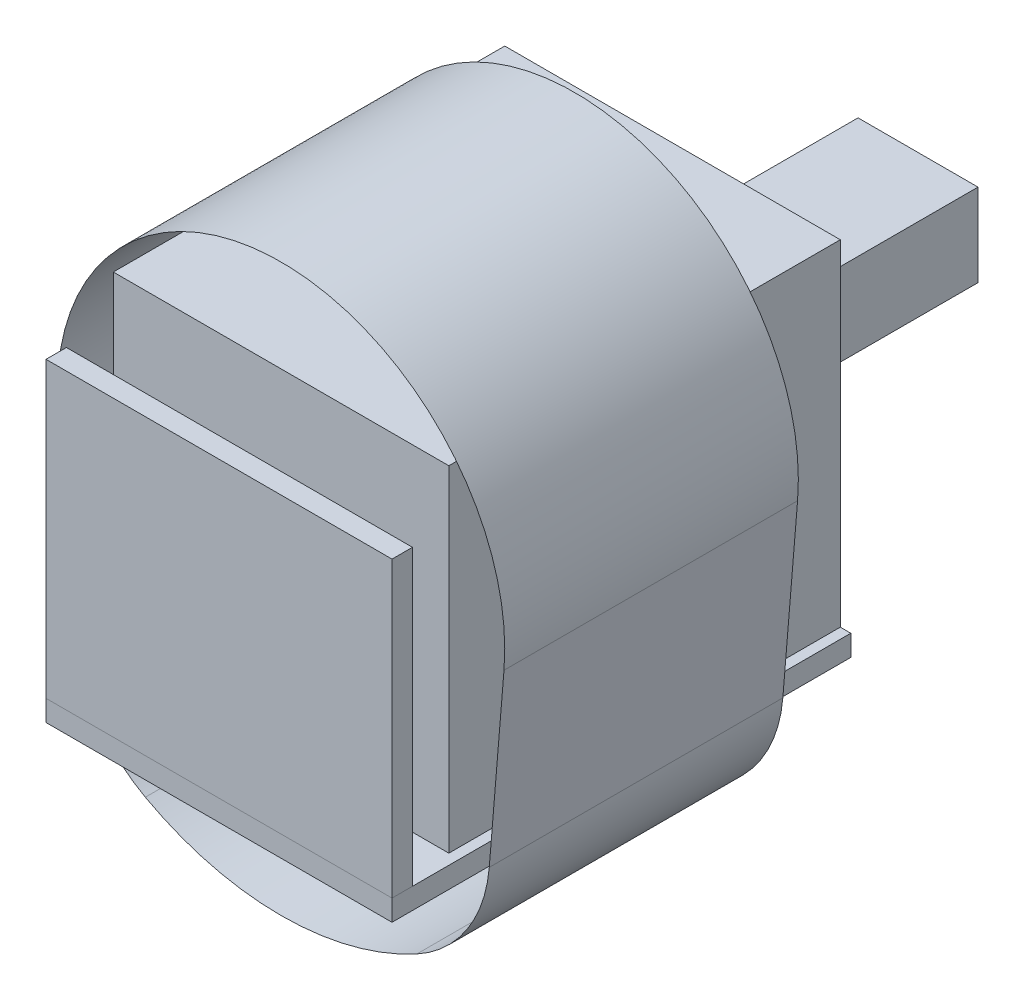
ISO-10303-21;
HEADER;
FILE_DESCRIPTION(('STEP AP214'),'2;1');
FILE_NAME('part.step','',(''),(''),'','','');
FILE_SCHEMA(('AUTOMOTIVE_DESIGN { 1 0 10303 214 1 1 1 1 }'));
ENDSEC;
DATA;
#1=APPLICATION_CONTEXT('core data for automotive mechanical design processes');
#2=APPLICATION_PROTOCOL_DEFINITION('international standard','automotive_design',2000,#1);
#3=PRODUCT_CONTEXT('',#1,'mechanical');
#4=PRODUCT('Part','Part','',(#3));
#5=PRODUCT_RELATED_PRODUCT_CATEGORY('part','',(#4));
#6=PRODUCT_DEFINITION_FORMATION('','',#4);
#7=PRODUCT_DEFINITION_CONTEXT('part definition',#1,'design');
#8=PRODUCT_DEFINITION('design','',#6,#7);
#9=PRODUCT_DEFINITION_SHAPE('','',#8);
#10=(LENGTH_UNIT() NAMED_UNIT(*) SI_UNIT(.MILLI.,.METRE.));
#11=(NAMED_UNIT(*) PLANE_ANGLE_UNIT() SI_UNIT($,.RADIAN.));
#12=(NAMED_UNIT(*) SI_UNIT($,.STERADIAN.) SOLID_ANGLE_UNIT());
#13=UNCERTAINTY_MEASURE_WITH_UNIT(LENGTH_MEASURE(1.E-05),#10,'distance_accuracy_value','');
#14=(GEOMETRIC_REPRESENTATION_CONTEXT(3) GLOBAL_UNCERTAINTY_ASSIGNED_CONTEXT((#13)) GLOBAL_UNIT_ASSIGNED_CONTEXT((#10,
#11,#12)) REPRESENTATION_CONTEXT('',''));
#15=CARTESIAN_POINT('',(0.,0.,0.));
#16=DIRECTION('',(0.,0.,1.));
#17=DIRECTION('',(1.,0.,0.));
#18=AXIS2_PLACEMENT_3D('',#15,#16,#17);
#19=CARTESIAN_POINT('',(0.,25.670679999093,-7.68010425848607));
#20=DIRECTION('',(1.,0.,0.));
#21=DIRECTION('',(0.,0.,-1.));
#22=AXIS2_PLACEMENT_3D('',#19,#20,#21);
#23=PLANE('',#22);
#24=DIRECTION('',(0.,0.,1.));
#25=VECTOR('',#24,1.);
#26=CARTESIAN_POINT('',(0.,15.170679999093,-7.68010425848607));
#27=LINE('',#26,#25);
#28=CARTESIAN_POINT('',(0.,15.170679999093,-8.41076612699066));
#29=VERTEX_POINT('',#28);
#30=CARTESIAN_POINT('',(0.,15.170679999093,-7.68010425848607));
#31=VERTEX_POINT('',#30);
#32=EDGE_CURVE('E109',#29,#31,#27,.T.);
#33=ORIENTED_EDGE('',*,*,#32,.T.);
#34=DIRECTION('',(0.,-1.,0.));
#35=VECTOR('',#34,1.);
#36=CARTESIAN_POINT('',(0.,25.670679999093,-7.68010425848607));
#37=LINE('',#36,#35);
#38=CARTESIAN_POINT('',(0.,25.670679999093,-7.68010425848607));
#39=VERTEX_POINT('',#38);
#40=EDGE_CURVE('E12',#39,#31,#37,.T.);
#41=ORIENTED_EDGE('',*,*,#40,.F.);
#42=DIRECTION('',(0.,0.,1.));
#43=VECTOR('',#42,1.);
#44=CARTESIAN_POINT('',(0.,25.670679999093,-7.68010425848607));
#45=LINE('',#44,#43);
#46=CARTESIAN_POINT('',(0.,25.670679999093,-8.41076612699066));
#47=VERTEX_POINT('',#46);
#48=EDGE_CURVE('E97',#47,#39,#45,.T.);
#49=ORIENTED_EDGE('',*,*,#48,.F.);
#50=DIRECTION('',(0.,-1.,0.));
#51=VECTOR('',#50,1.);
#52=CARTESIAN_POINT('',(0.,25.670679999093,-8.41076612699066));
#53=LINE('',#52,#51);
#54=EDGE_CURVE('E105',#47,#29,#53,.T.);
#55=ORIENTED_EDGE('',*,*,#54,.T.);
#56=EDGE_LOOP('',(#33,#41,#49,#55));
#57=FACE_BOUND('',#56,.T.);
#58=ADVANCED_FACE('F46',(#57),#23,.F.);
#59=CARTESIAN_POINT('',(0.,25.670679999093,-7.68010425848607));
#60=DIRECTION('',(0.,0.,-1.));
#61=DIRECTION('',(-1.,0.,0.));
#62=AXIS2_PLACEMENT_3D('',#59,#60,#61);
#63=PLANE('',#62);
#64=DIRECTION('',(1.,0.,0.));
#65=VECTOR('',#64,1.);
#66=CARTESIAN_POINT('',(0.,15.170679999093,-7.68010425848607));
#67=LINE('',#66,#65);
#68=CARTESIAN_POINT('',(12.375,15.170679999093,-7.68010425848607));
#69=VERTEX_POINT('',#68);
#70=EDGE_CURVE('E101',#31,#69,#67,.T.);
#71=ORIENTED_EDGE('',*,*,#70,.T.);
#72=DIRECTION('',(0.,-1.,0.));
#73=VECTOR('',#72,1.);
#74=CARTESIAN_POINT('',(12.375,25.670679999093,-7.68010425848607));
#75=LINE('',#74,#73);
#76=CARTESIAN_POINT('',(12.375,25.670679999093,-7.68010425848607));
#77=VERTEX_POINT('',#76);
#78=EDGE_CURVE('E54',#77,#69,#75,.T.);
#79=ORIENTED_EDGE('',*,*,#78,.F.);
#80=DIRECTION('',(1.,0.,0.));
#81=VECTOR('',#80,1.);
#82=CARTESIAN_POINT('',(0.,25.670679999093,-7.68010425848607));
#83=LINE('',#82,#81);
#84=EDGE_CURVE('E92',#39,#77,#83,.T.);
#85=ORIENTED_EDGE('',*,*,#84,.F.);
#86=ORIENTED_EDGE('',*,*,#40,.T.);
#87=EDGE_LOOP('',(#71,#79,#85,#86));
#88=FACE_BOUND('',#87,.T.);
#89=ADVANCED_FACE('F100',(#88),#63,.F.);
#90=CARTESIAN_POINT('',(12.375,25.670679999093,-7.68010425848607));
#91=DIRECTION('',(-1.,0.,0.));
#92=DIRECTION('',(0.,0.,1.));
#93=AXIS2_PLACEMENT_3D('',#90,#91,#92);
#94=PLANE('',#93);
#95=DIRECTION('',(0.,0.,-1.));
#96=VECTOR('',#95,1.);
#97=CARTESIAN_POINT('',(12.375,15.170679999093,-7.68010425848607));
#98=LINE('',#97,#96);
#99=CARTESIAN_POINT('',(12.375,15.170679999093,-8.41076612699066));
#100=VERTEX_POINT('',#99);
#101=EDGE_CURVE('E79',#69,#100,#98,.T.);
#102=ORIENTED_EDGE('',*,*,#101,.T.);
#103=DIRECTION('',(0.,-1.,0.));
#104=VECTOR('',#103,1.);
#105=CARTESIAN_POINT('',(12.375,25.670679999093,-8.41076612699066));
#106=LINE('',#105,#104);
#107=CARTESIAN_POINT('',(12.375,25.670679999093,-8.41076612699066));
#108=VERTEX_POINT('',#107);
#109=EDGE_CURVE('E102',#108,#100,#106,.T.);
#110=ORIENTED_EDGE('',*,*,#109,.F.);
#111=DIRECTION('',(0.,0.,-1.));
#112=VECTOR('',#111,1.);
#113=CARTESIAN_POINT('',(12.375,25.670679999093,-7.68010425848607));
#114=LINE('',#113,#112);
#115=EDGE_CURVE('E95',#77,#108,#114,.T.);
#116=ORIENTED_EDGE('',*,*,#115,.F.);
#117=ORIENTED_EDGE('',*,*,#78,.T.);
#118=EDGE_LOOP('',(#102,#110,#116,#117));
#119=FACE_BOUND('',#118,.T.);
#120=ADVANCED_FACE('F103',(#119),#94,.F.);
#121=CARTESIAN_POINT('',(0.,25.670679999093,-8.41076612699066));
#122=DIRECTION('',(0.,0.,1.));
#123=DIRECTION('',(1.,0.,0.));
#124=AXIS2_PLACEMENT_3D('',#121,#122,#123);
#125=PLANE('',#124);
#126=DIRECTION('',(-1.,0.,0.));
#127=VECTOR('',#126,1.);
#128=CARTESIAN_POINT('',(0.,15.170679999093,-8.41076612699066));
#129=LINE('',#128,#127);
#130=EDGE_CURVE('E85',#100,#29,#129,.T.);
#131=ORIENTED_EDGE('',*,*,#130,.T.);
#132=ORIENTED_EDGE('',*,*,#54,.F.);
#133=DIRECTION('',(-1.,0.,0.));
#134=VECTOR('',#133,1.);
#135=CARTESIAN_POINT('',(0.,25.670679999093,-8.41076612699066));
#136=LINE('',#135,#134);
#137=EDGE_CURVE('E62',#108,#47,#136,.T.);
#138=ORIENTED_EDGE('',*,*,#137,.F.);
#139=ORIENTED_EDGE('',*,*,#109,.T.);
#140=EDGE_LOOP('',(#131,#132,#138,#139));
#141=FACE_BOUND('',#140,.T.);
#142=ADVANCED_FACE('F116',(#141),#125,.F.);
#143=CARTESIAN_POINT('',(0.,25.670679999093,0.));
#144=DIRECTION('',(0.,-1.,0.));
#145=DIRECTION('',(0.,0.,-1.));
#146=AXIS2_PLACEMENT_3D('',#143,#144,#145);
#147=PLANE('',#146);
#148=ORIENTED_EDGE('',*,*,#48,.T.);
#149=ORIENTED_EDGE('',*,*,#84,.T.);
#150=ORIENTED_EDGE('',*,*,#115,.T.);
#151=ORIENTED_EDGE('',*,*,#137,.T.);
#152=EDGE_LOOP('',(#148,#149,#150,#151));
#153=FACE_BOUND('',#152,.T.);
#154=ADVANCED_FACE('F93',(#153),#147,.F.);
#155=CARTESIAN_POINT('',(0.,15.170679999093,0.));
#156=DIRECTION('',(0.,-1.,0.));
#157=DIRECTION('',(0.,0.,-1.));
#158=AXIS2_PLACEMENT_3D('',#155,#156,#157);
#159=PLANE('',#158);
#160=ORIENTED_EDGE('',*,*,#32,.F.);
#161=ORIENTED_EDGE('',*,*,#130,.F.);
#162=ORIENTED_EDGE('',*,*,#101,.F.);
#163=ORIENTED_EDGE('',*,*,#70,.F.);
#164=EDGE_LOOP('',(#160,#161,#162,#163));
#165=FACE_BOUND('',#164,.T.);
#166=ADVANCED_FACE('F119',(#165),#159,.T.);
#167=CLOSED_SHELL('',(#58,#89,#120,#142,#154,#166));
#168=MANIFOLD_SOLID_BREP('B2',#167);
#169=CARTESIAN_POINT('',(8.46223135129487,15.8661353480475,-10.0873183230166));
#170=DIRECTION('',(0.,0.,-1.));
#171=DIRECTION('',(-1.,0.,0.));
#172=AXIS2_PLACEMENT_3D('',#169,#170,#171);
#173=CYLINDRICAL_SURFACE('',#172,5.);
#174=CARTESIAN_POINT('',(8.46223135129487,15.8661353480475,-20.5873183230166));
#175=DIRECTION('',(0.,0.,1.));
#176=DIRECTION('',(-1.,0.,0.));
#177=AXIS2_PLACEMENT_3D('',#174,#175,#176);
#178=CIRCLE('',#177,5.);
#179=CARTESIAN_POINT('',(10.8556256384926,11.4761850310155,-20.5873183230166));
#180=VERTEX_POINT('',#179);
#181=CARTESIAN_POINT('',(13.4451720185552,15.4534583477641,-20.5873183230166));
#182=VERTEX_POINT('',#181);
#183=EDGE_CURVE('E188',#180,#182,#178,.T.);
#184=ORIENTED_EDGE('',*,*,#183,.F.);
#185=DIRECTION('',(0.,0.,-1.));
#186=VECTOR('',#185,1.);
#187=CARTESIAN_POINT('',(10.8556256384926,11.4761850310155,-10.0873183230166));
#188=LINE('',#187,#186);
#189=CARTESIAN_POINT('',(10.8556256384926,11.4761850310155,-10.0873183230166));
#190=VERTEX_POINT('',#189);
#191=EDGE_CURVE('E196',#190,#180,#188,.T.);
#192=ORIENTED_EDGE('',*,*,#191,.F.);
#193=CARTESIAN_POINT('',(8.46223135129487,15.8661353480475,-10.0873183230166));
#194=DIRECTION('',(0.,0.,1.));
#195=DIRECTION('',(-1.,0.,0.));
#196=AXIS2_PLACEMENT_3D('',#193,#194,#195);
#197=CIRCLE('',#196,5.);
#198=CARTESIAN_POINT('',(13.4451720185552,15.4534583477641,-10.0873183230166));
#199=VERTEX_POINT('',#198);
#200=EDGE_CURVE('E44',#190,#199,#197,.T.);
#201=ORIENTED_EDGE('',*,*,#200,.T.);
#202=DIRECTION('',(0.,0.,-1.));
#203=VECTOR('',#202,1.);
#204=CARTESIAN_POINT('',(13.4451720185552,15.4534583477641,-10.0873183230166));
#205=LINE('',#204,#203);
#206=EDGE_CURVE('E182',#199,#182,#205,.T.);
#207=ORIENTED_EDGE('',*,*,#206,.T.);
#208=EDGE_LOOP('',(#184,#192,#201,#207));
#209=FACE_BOUND('',#208,.T.);
#210=ADVANCED_FACE('F180',(#209),#173,.F.);
#211=CARTESIAN_POINT('',(13.4451720185552,15.4534583477641,-10.0873183230166));
#212=DIRECTION('',(-0.996588133452072,0.0825354000566722,0.));
#213=DIRECTION('',(-0.0825354000566722,-0.996588133452072,0.));
#214=AXIS2_PLACEMENT_3D('',#211,#212,#213);
#215=PLANE('',#214);
#216=DIRECTION('',(0.0825354000566722,0.996588133452072,0.));
#217=VECTOR('',#216,1.);
#218=CARTESIAN_POINT('',(13.4451720185552,15.4534583477641,-20.5873183230166));
#219=LINE('',#218,#217);
#220=CARTESIAN_POINT('',(13.9727050676166,21.8232484782697,-20.5873183230166));
#221=VERTEX_POINT('',#220);
#222=EDGE_CURVE('E270',#182,#221,#219,.T.);
#223=ORIENTED_EDGE('',*,*,#222,.F.);
#224=ORIENTED_EDGE('',*,*,#206,.F.);
#225=DIRECTION('',(0.0825354000566722,0.996588133452072,0.));
#226=VECTOR('',#225,1.);
#227=CARTESIAN_POINT('',(13.4451720185552,15.4534583477641,-10.0873183230166));
#228=LINE('',#227,#226);
#229=CARTESIAN_POINT('',(13.9727050676166,21.8232484782697,-10.0873183230166));
#230=VERTEX_POINT('',#229);
#231=EDGE_CURVE('E284',#199,#230,#228,.T.);
#232=ORIENTED_EDGE('',*,*,#231,.T.);
#233=DIRECTION('',(0.,0.,-1.));
#234=VECTOR('',#233,1.);
#235=CARTESIAN_POINT('',(13.9727050676166,21.8232484782697,-10.0873183230166));
#236=LINE('',#235,#234);
#237=EDGE_CURVE('E264',#230,#221,#236,.T.);
#238=ORIENTED_EDGE('',*,*,#237,.T.);
#239=EDGE_LOOP('',(#223,#224,#232,#238));
#240=FACE_BOUND('',#239,.T.);
#241=ADVANCED_FACE('F298',(#240),#215,.T.);
#242=CARTESIAN_POINT('',(6.,22.4835316787231,-10.0873183230166));
#243=DIRECTION('',(0.,0.,-1.));
#244=DIRECTION('',(-1.,0.,0.));
#245=AXIS2_PLACEMENT_3D('',#242,#243,#244);
#246=CYLINDRICAL_SURFACE('',#245,8.);
#247=CARTESIAN_POINT('',(6.,22.4835316787231,-20.5873183230166));
#248=DIRECTION('',(0.,0.,1.));
#249=DIRECTION('',(1.,0.,0.));
#250=AXIS2_PLACEMENT_3D('',#247,#248,#249);
#251=CIRCLE('',#250,8.);
#252=CARTESIAN_POINT('',(-1.97270506761657,21.8232484782697,-20.5873183230166));
#253=VERTEX_POINT('',#252);
#254=EDGE_CURVE('E257',#221,#253,#251,.T.);
#255=ORIENTED_EDGE('',*,*,#254,.F.);
#256=ORIENTED_EDGE('',*,*,#237,.F.);
#257=CARTESIAN_POINT('',(6.,22.4835316787231,-10.0873183230166));
#258=DIRECTION('',(0.,0.,1.));
#259=DIRECTION('',(1.,0.,0.));
#260=AXIS2_PLACEMENT_3D('',#257,#258,#259);
#261=CIRCLE('',#260,8.);
#262=CARTESIAN_POINT('',(-1.97270506761657,21.8232484782697,-10.0873183230166));
#263=VERTEX_POINT('',#262);
#264=EDGE_CURVE('E273',#230,#263,#261,.T.);
#265=ORIENTED_EDGE('',*,*,#264,.T.);
#266=DIRECTION('',(0.,0.,-1.));
#267=VECTOR('',#266,1.);
#268=CARTESIAN_POINT('',(-1.97270506761657,21.8232484782697,-10.0873183230166));
#269=LINE('',#268,#267);
#270=EDGE_CURVE('E254',#263,#253,#269,.T.);
#271=ORIENTED_EDGE('',*,*,#270,.T.);
#272=EDGE_LOOP('',(#255,#256,#265,#271));
#273=FACE_BOUND('',#272,.T.);
#274=ADVANCED_FACE('F300',(#273),#246,.F.);
#275=CARTESIAN_POINT('',(-1.44517201855523,15.4534583477641,-10.0873183230166));
#276=DIRECTION('',(0.996588133452072,0.0825354000566723,0.));
#277=DIRECTION('',(-0.0825354000566723,0.996588133452072,0.));
#278=AXIS2_PLACEMENT_3D('',#275,#276,#277);
#279=PLANE('',#278);
#280=DIRECTION('',(0.0825354000566723,-0.996588133452072,0.));
#281=VECTOR('',#280,1.);
#282=CARTESIAN_POINT('',(-1.44517201855523,15.4534583477641,-20.5873183230166));
#283=LINE('',#282,#281);
#284=CARTESIAN_POINT('',(-1.44517201855523,15.4534583477641,-20.5873183230166));
#285=VERTEX_POINT('',#284);
#286=EDGE_CURVE('E249',#253,#285,#283,.T.);
#287=ORIENTED_EDGE('',*,*,#286,.F.);
#288=ORIENTED_EDGE('',*,*,#270,.F.);
#289=DIRECTION('',(0.0825354000566723,-0.996588133452072,0.));
#290=VECTOR('',#289,1.);
#291=CARTESIAN_POINT('',(-1.44517201855523,15.4534583477641,-10.0873183230166));
#292=LINE('',#291,#290);
#293=CARTESIAN_POINT('',(-1.44517201855523,15.4534583477641,-10.0873183230166));
#294=VERTEX_POINT('',#293);
#295=EDGE_CURVE('E252',#263,#294,#292,.T.);
#296=ORIENTED_EDGE('',*,*,#295,.T.);
#297=DIRECTION('',(0.,0.,-1.));
#298=VECTOR('',#297,1.);
#299=CARTESIAN_POINT('',(-1.44517201855523,15.4534583477641,-10.0873183230166));
#300=LINE('',#299,#298);
#301=EDGE_CURVE('E237',#294,#285,#300,.T.);
#302=ORIENTED_EDGE('',*,*,#301,.T.);
#303=EDGE_LOOP('',(#287,#288,#296,#302));
#304=FACE_BOUND('',#303,.T.);
#305=ADVANCED_FACE('F253',(#304),#279,.T.);
#306=CARTESIAN_POINT('',(3.53776864870513,15.8661353480475,-10.0873183230166));
#307=DIRECTION('',(0.,0.,-1.));
#308=DIRECTION('',(-1.,0.,0.));
#309=AXIS2_PLACEMENT_3D('',#306,#307,#308);
#310=CYLINDRICAL_SURFACE('',#309,5.);
#311=CARTESIAN_POINT('',(3.53776864870513,15.8661353480475,-20.5873183230166));
#312=DIRECTION('',(0.,0.,1.));
#313=DIRECTION('',(1.,0.,0.));
#314=AXIS2_PLACEMENT_3D('',#311,#312,#313);
#315=CIRCLE('',#314,5.);
#316=CARTESIAN_POINT('',(1.14437436150741,11.4761850310155,-20.5873183230166));
#317=VERTEX_POINT('',#316);
#318=EDGE_CURVE('E242',#285,#317,#315,.T.);
#319=ORIENTED_EDGE('',*,*,#318,.F.);
#320=ORIENTED_EDGE('',*,*,#301,.F.);
#321=CARTESIAN_POINT('',(3.53776864870513,15.8661353480475,-10.0873183230166));
#322=DIRECTION('',(0.,0.,1.));
#323=DIRECTION('',(1.,0.,0.));
#324=AXIS2_PLACEMENT_3D('',#321,#322,#323);
#325=CIRCLE('',#324,5.);
#326=CARTESIAN_POINT('',(1.14437436150741,11.4761850310155,-10.0873183230166));
#327=VERTEX_POINT('',#326);
#328=EDGE_CURVE('E240',#294,#327,#325,.T.);
#329=ORIENTED_EDGE('',*,*,#328,.T.);
#330=DIRECTION('',(0.,0.,-1.));
#331=VECTOR('',#330,1.);
#332=CARTESIAN_POINT('',(1.14437436150741,11.4761850310155,-10.0873183230166));
#333=LINE('',#332,#331);
#334=EDGE_CURVE('E219',#327,#317,#333,.T.);
#335=ORIENTED_EDGE('',*,*,#334,.T.);
#336=EDGE_LOOP('',(#319,#320,#329,#335));
#337=FACE_BOUND('',#336,.T.);
#338=ADVANCED_FACE('F239',(#337),#310,.F.);
#339=CARTESIAN_POINT('',(6.,20.3823462202138,-10.0873183230166));
#340=DIRECTION('',(0.,0.,-1.));
#341=DIRECTION('',(-1.,0.,0.));
#342=AXIS2_PLACEMENT_3D('',#339,#340,#341);
#343=CYLINDRICAL_SURFACE('',#342,10.1438063599996);
#344=CARTESIAN_POINT('',(6.,20.3823462202138,-20.5873183230166));
#345=DIRECTION('',(0.,0.,1.));
#346=DIRECTION('',(1.,0.,0.));
#347=AXIS2_PLACEMENT_3D('',#344,#345,#346);
#348=CIRCLE('',#347,10.1438063599996);
#349=EDGE_CURVE('E277',#317,#180,#348,.T.);
#350=ORIENTED_EDGE('',*,*,#349,.F.);
#351=ORIENTED_EDGE('',*,*,#334,.F.);
#352=CARTESIAN_POINT('',(6.,20.3823462202138,-10.0873183230166));
#353=DIRECTION('',(0.,0.,1.));
#354=DIRECTION('',(1.,0.,0.));
#355=AXIS2_PLACEMENT_3D('',#352,#353,#354);
#356=CIRCLE('',#355,10.1438063599996);
#357=EDGE_CURVE('E268',#327,#190,#356,.T.);
#358=ORIENTED_EDGE('',*,*,#357,.T.);
#359=ORIENTED_EDGE('',*,*,#191,.T.);
#360=EDGE_LOOP('',(#350,#351,#358,#359));
#361=FACE_BOUND('',#360,.T.);
#362=ADVANCED_FACE('F311',(#361),#343,.F.);
#363=OPEN_SHELL('',(#210,#241,#274,#305,#338,#362));
#364=SHELL_BASED_SURFACE_MODEL('B6',(#363));
#365=CARTESIAN_POINT('',(3.04403323661144,13.920679999093,-8.8640534852391));
#366=DIRECTION('',(1.,0.,0.));
#367=DIRECTION('',(0.,0.,-1.));
#368=AXIS2_PLACEMENT_3D('',#365,#366,#367);
#369=PLANE('',#368);
#370=DIRECTION('',(0.,0.,-1.));
#371=VECTOR('',#370,1.);
#372=CARTESIAN_POINT('',(3.04403323661144,14.420679999093,-8.8640534852391));
#373=LINE('',#372,#371);
#374=CARTESIAN_POINT('',(3.04403323661144,14.420679999093,-8.8640534852391));
#375=VERTEX_POINT('',#374);
#376=CARTESIAN_POINT('',(3.04403323661144,14.420679999093,-10.3640534852391));
#377=VERTEX_POINT('',#376);
#378=EDGE_CURVE('E443',#375,#377,#373,.T.);
#379=ORIENTED_EDGE('',*,*,#378,.T.);
#380=DIRECTION('',(0.,1.,0.));
#381=VECTOR('',#380,1.);
#382=CARTESIAN_POINT('',(3.04403323661144,13.920679999093,-10.3640534852391));
#383=LINE('',#382,#381);
#384=CARTESIAN_POINT('',(3.04403323661144,13.920679999093,-10.3640534852391));
#385=VERTEX_POINT('',#384);
#386=EDGE_CURVE('E178',#385,#377,#383,.T.);
#387=ORIENTED_EDGE('',*,*,#386,.F.);
#388=DIRECTION('',(0.,0.,-1.));
#389=VECTOR('',#388,1.);
#390=CARTESIAN_POINT('',(3.04403323661144,13.920679999093,-8.8640534852391));
#391=LINE('',#390,#389);
#392=CARTESIAN_POINT('',(3.04403323661144,13.920679999093,-8.8640534852391));
#393=VERTEX_POINT('',#392);
#394=EDGE_CURVE('E431',#393,#385,#391,.T.);
#395=ORIENTED_EDGE('',*,*,#394,.F.);
#396=DIRECTION('',(0.,1.,0.));
#397=VECTOR('',#396,1.);
#398=CARTESIAN_POINT('',(3.04403323661144,13.920679999093,-8.8640534852391));
#399=LINE('',#398,#397);
#400=EDGE_CURVE('E439',#393,#375,#399,.T.);
#401=ORIENTED_EDGE('',*,*,#400,.T.);
#402=EDGE_LOOP('',(#379,#387,#395,#401));
#403=FACE_BOUND('',#402,.T.);
#404=ADVANCED_FACE('F380',(#403),#369,.F.);
#405=CARTESIAN_POINT('',(3.04403323661144,13.920679999093,-10.3640534852391));
#406=DIRECTION('',(0.,0.,1.));
#407=DIRECTION('',(1.,0.,0.));
#408=AXIS2_PLACEMENT_3D('',#405,#406,#407);
#409=PLANE('',#408);
#410=DIRECTION('',(1.,0.,0.));
#411=VECTOR('',#410,1.);
#412=CARTESIAN_POINT('',(3.04403323661144,14.420679999093,-10.3640534852391));
#413=LINE('',#412,#411);
#414=CARTESIAN_POINT('',(6.04403323661144,14.420679999093,-10.3640534852391));
#415=VERTEX_POINT('',#414);
#416=EDGE_CURVE('E435',#377,#415,#413,.T.);
#417=ORIENTED_EDGE('',*,*,#416,.T.);
#418=DIRECTION('',(0.,1.,0.));
#419=VECTOR('',#418,1.);
#420=CARTESIAN_POINT('',(6.04403323661144,13.920679999093,-10.3640534852391));
#421=LINE('',#420,#419);
#422=CARTESIAN_POINT('',(6.04403323661144,13.920679999093,-10.3640534852391));
#423=VERTEX_POINT('',#422);
#424=EDGE_CURVE('E388',#423,#415,#421,.T.);
#425=ORIENTED_EDGE('',*,*,#424,.F.);
#426=DIRECTION('',(1.,0.,0.));
#427=VECTOR('',#426,1.);
#428=CARTESIAN_POINT('',(3.04403323661144,13.920679999093,-10.3640534852391));
#429=LINE('',#428,#427);
#430=EDGE_CURVE('E426',#385,#423,#429,.T.);
#431=ORIENTED_EDGE('',*,*,#430,.F.);
#432=ORIENTED_EDGE('',*,*,#386,.T.);
#433=EDGE_LOOP('',(#417,#425,#431,#432));
#434=FACE_BOUND('',#433,.T.);
#435=ADVANCED_FACE('F434',(#434),#409,.F.);
#436=CARTESIAN_POINT('',(6.04403323661144,13.920679999093,-8.8640534852391));
#437=DIRECTION('',(-1.,0.,0.));
#438=DIRECTION('',(0.,0.,1.));
#439=AXIS2_PLACEMENT_3D('',#436,#437,#438);
#440=PLANE('',#439);
#441=DIRECTION('',(0.,0.,1.));
#442=VECTOR('',#441,1.);
#443=CARTESIAN_POINT('',(6.04403323661144,14.420679999093,-8.8640534852391));
#444=LINE('',#443,#442);
#445=CARTESIAN_POINT('',(6.04403323661144,14.420679999093,-8.8640534852391));
#446=VERTEX_POINT('',#445);
#447=EDGE_CURVE('E413',#415,#446,#444,.T.);
#448=ORIENTED_EDGE('',*,*,#447,.T.);
#449=DIRECTION('',(0.,1.,0.));
#450=VECTOR('',#449,1.);
#451=CARTESIAN_POINT('',(6.04403323661144,13.920679999093,-8.8640534852391));
#452=LINE('',#451,#450);
#453=CARTESIAN_POINT('',(6.04403323661144,13.920679999093,-8.8640534852391));
#454=VERTEX_POINT('',#453);
#455=EDGE_CURVE('E436',#454,#446,#452,.T.);
#456=ORIENTED_EDGE('',*,*,#455,.F.);
#457=DIRECTION('',(0.,0.,1.));
#458=VECTOR('',#457,1.);
#459=CARTESIAN_POINT('',(6.04403323661144,13.920679999093,-8.8640534852391));
#460=LINE('',#459,#458);
#461=EDGE_CURVE('E429',#423,#454,#460,.T.);
#462=ORIENTED_EDGE('',*,*,#461,.F.);
#463=ORIENTED_EDGE('',*,*,#424,.T.);
#464=EDGE_LOOP('',(#448,#456,#462,#463));
#465=FACE_BOUND('',#464,.T.);
#466=ADVANCED_FACE('F437',(#465),#440,.F.);
#467=CARTESIAN_POINT('',(3.04403323661144,13.920679999093,-8.8640534852391));
#468=DIRECTION('',(0.,0.,-1.));
#469=DIRECTION('',(-1.,0.,0.));
#470=AXIS2_PLACEMENT_3D('',#467,#468,#469);
#471=PLANE('',#470);
#472=DIRECTION('',(-1.,0.,0.));
#473=VECTOR('',#472,1.);
#474=CARTESIAN_POINT('',(3.04403323661144,14.420679999093,-8.8640534852391));
#475=LINE('',#474,#473);
#476=EDGE_CURVE('E419',#446,#375,#475,.T.);
#477=ORIENTED_EDGE('',*,*,#476,.T.);
#478=ORIENTED_EDGE('',*,*,#400,.F.);
#479=DIRECTION('',(-1.,0.,0.));
#480=VECTOR('',#479,1.);
#481=CARTESIAN_POINT('',(3.04403323661144,13.920679999093,-8.8640534852391));
#482=LINE('',#481,#480);
#483=EDGE_CURVE('E396',#454,#393,#482,.T.);
#484=ORIENTED_EDGE('',*,*,#483,.F.);
#485=ORIENTED_EDGE('',*,*,#455,.T.);
#486=EDGE_LOOP('',(#477,#478,#484,#485));
#487=FACE_BOUND('',#486,.T.);
#488=ADVANCED_FACE('F450',(#487),#471,.F.);
#489=CARTESIAN_POINT('',(0.,13.920679999093,0.));
#490=DIRECTION('',(0.,-1.,0.));
#491=DIRECTION('',(0.,0.,-1.));
#492=AXIS2_PLACEMENT_3D('',#489,#490,#491);
#493=PLANE('',#492);
#494=ORIENTED_EDGE('',*,*,#394,.T.);
#495=ORIENTED_EDGE('',*,*,#430,.T.);
#496=ORIENTED_EDGE('',*,*,#461,.T.);
#497=ORIENTED_EDGE('',*,*,#483,.T.);
#498=EDGE_LOOP('',(#494,#495,#496,#497));
#499=FACE_BOUND('',#498,.T.);
#500=ADVANCED_FACE('F427',(#499),#493,.T.);
#501=CARTESIAN_POINT('',(0.,14.420679999093,0.));
#502=DIRECTION('',(0.,-1.,0.));
#503=DIRECTION('',(0.,0.,-1.));
#504=AXIS2_PLACEMENT_3D('',#501,#502,#503);
#505=PLANE('',#504);
#506=ORIENTED_EDGE('',*,*,#378,.F.);
#507=ORIENTED_EDGE('',*,*,#476,.F.);
#508=ORIENTED_EDGE('',*,*,#447,.F.);
#509=ORIENTED_EDGE('',*,*,#416,.F.);
#510=EDGE_LOOP('',(#506,#507,#508,#509));
#511=FACE_BOUND('',#510,.T.);
#512=ADVANCED_FACE('F453',(#511),#505,.F.);
#513=CLOSED_SHELL('',(#404,#435,#466,#488,#500,#512));
#514=MANIFOLD_SOLID_BREP('B38',#513);
#515=CARTESIAN_POINT('',(1.13465838133989,12.420679999093,-23.9233781550222));
#516=DIRECTION('',(1.,0.,0.));
#517=DIRECTION('',(0.,0.,-1.));
#518=AXIS2_PLACEMENT_3D('',#515,#516,#517);
#519=PLANE('',#518);
#520=DIRECTION('',(0.,0.,-1.));
#521=VECTOR('',#520,1.);
#522=CARTESIAN_POINT('',(1.13465838133989,14.420679999093,-23.9233781550222));
#523=LINE('',#522,#521);
#524=CARTESIAN_POINT('',(1.13465838133989,14.420679999093,-11.2233781550222));
#525=VERTEX_POINT('',#524);
#526=CARTESIAN_POINT('',(1.13465838133989,14.420679999093,-23.9233781550222));
#527=VERTEX_POINT('',#526);
#528=EDGE_CURVE('E577',#525,#527,#523,.T.);
#529=ORIENTED_EDGE('',*,*,#528,.T.);
#530=DIRECTION('',(0.,1.,0.));
#531=VECTOR('',#530,1.);
#532=CARTESIAN_POINT('',(1.13465838133989,12.420679999093,-23.9233781550222));
#533=LINE('',#532,#531);
#534=CARTESIAN_POINT('',(1.13465838133989,12.420679999093,-23.9233781550222));
#535=VERTEX_POINT('',#534);
#536=EDGE_CURVE('E378',#535,#527,#533,.T.);
#537=ORIENTED_EDGE('',*,*,#536,.F.);
#538=DIRECTION('',(0.,0.,-1.));
#539=VECTOR('',#538,1.);
#540=CARTESIAN_POINT('',(1.13465838133989,12.420679999093,-23.9233781550222));
#541=LINE('',#540,#539);
#542=CARTESIAN_POINT('',(1.13465838133989,12.420679999093,-11.2233781550222));
#543=VERTEX_POINT('',#542);
#544=EDGE_CURVE('E565',#543,#535,#541,.T.);
#545=ORIENTED_EDGE('',*,*,#544,.F.);
#546=DIRECTION('',(0.,1.,0.));
#547=VECTOR('',#546,1.);
#548=CARTESIAN_POINT('',(1.13465838133989,12.420679999093,-11.2233781550222));
#549=LINE('',#548,#547);
#550=EDGE_CURVE('E573',#543,#525,#549,.T.);
#551=ORIENTED_EDGE('',*,*,#550,.T.);
#552=EDGE_LOOP('',(#529,#537,#545,#551));
#553=FACE_BOUND('',#552,.T.);
#554=ADVANCED_FACE('F514',(#553),#519,.F.);
#555=CARTESIAN_POINT('',(1.13465838133989,12.420679999093,-23.9233781550222));
#556=DIRECTION('',(0.,0.,1.));
#557=DIRECTION('',(1.,0.,0.));
#558=AXIS2_PLACEMENT_3D('',#555,#556,#557);
#559=PLANE('',#558);
#560=DIRECTION('',(1.,0.,0.));
#561=VECTOR('',#560,1.);
#562=CARTESIAN_POINT('',(1.13465838133989,14.420679999093,-23.9233781550222));
#563=LINE('',#562,#561);
#564=CARTESIAN_POINT('',(10.0346583813399,14.420679999093,-23.9233781550222));
#565=VERTEX_POINT('',#564);
#566=EDGE_CURVE('E569',#527,#565,#563,.T.);
#567=ORIENTED_EDGE('',*,*,#566,.T.);
#568=DIRECTION('',(0.,1.,0.));
#569=VECTOR('',#568,1.);
#570=CARTESIAN_POINT('',(10.0346583813399,12.420679999093,-23.9233781550222));
#571=LINE('',#570,#569);
#572=CARTESIAN_POINT('',(10.0346583813399,12.420679999093,-23.9233781550222));
#573=VERTEX_POINT('',#572);
#574=EDGE_CURVE('E522',#573,#565,#571,.T.);
#575=ORIENTED_EDGE('',*,*,#574,.F.);
#576=DIRECTION('',(1.,0.,0.));
#577=VECTOR('',#576,1.);
#578=CARTESIAN_POINT('',(1.13465838133989,12.420679999093,-23.9233781550222));
#579=LINE('',#578,#577);
#580=EDGE_CURVE('E560',#535,#573,#579,.T.);
#581=ORIENTED_EDGE('',*,*,#580,.F.);
#582=ORIENTED_EDGE('',*,*,#536,.T.);
#583=EDGE_LOOP('',(#567,#575,#581,#582));
#584=FACE_BOUND('',#583,.T.);
#585=ADVANCED_FACE('F568',(#584),#559,.F.);
#586=CARTESIAN_POINT('',(10.0346583813399,12.420679999093,-23.9233781550222));
#587=DIRECTION('',(-1.,0.,0.));
#588=DIRECTION('',(0.,0.,1.));
#589=AXIS2_PLACEMENT_3D('',#586,#587,#588);
#590=PLANE('',#589);
#591=DIRECTION('',(0.,0.,1.));
#592=VECTOR('',#591,1.);
#593=CARTESIAN_POINT('',(10.0346583813399,14.420679999093,-23.9233781550222));
#594=LINE('',#593,#592);
#595=CARTESIAN_POINT('',(10.0346583813399,14.420679999093,-11.2233781550222));
#596=VERTEX_POINT('',#595);
#597=EDGE_CURVE('E547',#565,#596,#594,.T.);
#598=ORIENTED_EDGE('',*,*,#597,.T.);
#599=DIRECTION('',(0.,1.,0.));
#600=VECTOR('',#599,1.);
#601=CARTESIAN_POINT('',(10.0346583813399,12.420679999093,-11.2233781550222));
#602=LINE('',#601,#600);
#603=CARTESIAN_POINT('',(10.0346583813399,12.420679999093,-11.2233781550222));
#604=VERTEX_POINT('',#603);
#605=EDGE_CURVE('E570',#604,#596,#602,.T.);
#606=ORIENTED_EDGE('',*,*,#605,.F.);
#607=DIRECTION('',(0.,0.,1.));
#608=VECTOR('',#607,1.);
#609=CARTESIAN_POINT('',(10.0346583813399,12.420679999093,-23.9233781550222));
#610=LINE('',#609,#608);
#611=EDGE_CURVE('E563',#573,#604,#610,.T.);
#612=ORIENTED_EDGE('',*,*,#611,.F.);
#613=ORIENTED_EDGE('',*,*,#574,.T.);
#614=EDGE_LOOP('',(#598,#606,#612,#613));
#615=FACE_BOUND('',#614,.T.);
#616=ADVANCED_FACE('F571',(#615),#590,.F.);
#617=CARTESIAN_POINT('',(1.13465838133989,12.420679999093,-11.2233781550222));
#618=DIRECTION('',(0.,0.,-1.));
#619=DIRECTION('',(-1.,0.,0.));
#620=AXIS2_PLACEMENT_3D('',#617,#618,#619);
#621=PLANE('',#620);
#622=DIRECTION('',(-1.,0.,0.));
#623=VECTOR('',#622,1.);
#624=CARTESIAN_POINT('',(1.13465838133989,14.420679999093,-11.2233781550222));
#625=LINE('',#624,#623);
#626=EDGE_CURVE('E553',#596,#525,#625,.T.);
#627=ORIENTED_EDGE('',*,*,#626,.T.);
#628=ORIENTED_EDGE('',*,*,#550,.F.);
#629=DIRECTION('',(-1.,0.,0.));
#630=VECTOR('',#629,1.);
#631=CARTESIAN_POINT('',(1.13465838133989,12.420679999093,-11.2233781550222));
#632=LINE('',#631,#630);
#633=EDGE_CURVE('E530',#604,#543,#632,.T.);
#634=ORIENTED_EDGE('',*,*,#633,.F.);
#635=ORIENTED_EDGE('',*,*,#605,.T.);
#636=EDGE_LOOP('',(#627,#628,#634,#635));
#637=FACE_BOUND('',#636,.T.);
#638=ADVANCED_FACE('F584',(#637),#621,.F.);
#639=CARTESIAN_POINT('',(0.,12.420679999093,0.));
#640=DIRECTION('',(0.,1.,0.));
#641=DIRECTION('',(0.,0.,1.));
#642=AXIS2_PLACEMENT_3D('',#639,#640,#641);
#643=PLANE('',#642);
#644=ORIENTED_EDGE('',*,*,#544,.T.);
#645=ORIENTED_EDGE('',*,*,#580,.T.);
#646=ORIENTED_EDGE('',*,*,#611,.T.);
#647=ORIENTED_EDGE('',*,*,#633,.T.);
#648=EDGE_LOOP('',(#644,#645,#646,#647));
#649=FACE_BOUND('',#648,.T.);
#650=ADVANCED_FACE('F561',(#649),#643,.F.);
#651=CARTESIAN_POINT('',(0.,14.420679999093,0.));
#652=DIRECTION('',(0.,1.,0.));
#653=DIRECTION('',(0.,0.,1.));
#654=AXIS2_PLACEMENT_3D('',#651,#652,#653);
#655=PLANE('',#654);
#656=ORIENTED_EDGE('',*,*,#528,.F.);
#657=ORIENTED_EDGE('',*,*,#626,.F.);
#658=ORIENTED_EDGE('',*,*,#597,.F.);
#659=ORIENTED_EDGE('',*,*,#566,.F.);
#660=EDGE_LOOP('',(#656,#657,#658,#659));
#661=FACE_BOUND('',#660,.T.);
#662=ADVANCED_FACE('F587',(#661),#655,.T.);
#663=CLOSED_SHELL('',(#554,#585,#616,#638,#650,#662));
#664=MANIFOLD_SOLID_BREP('B172',#663);
#665=CARTESIAN_POINT('',(0.,14.420679999093,-7.68010425848607));
#666=DIRECTION('',(1.,0.,0.));
#667=DIRECTION('',(0.,0.,-1.));
#668=AXIS2_PLACEMENT_3D('',#665,#666,#667);
#669=PLANE('',#668);
#670=DIRECTION('',(0.,0.,-1.));
#671=VECTOR('',#670,1.);
#672=CARTESIAN_POINT('',(0.,15.170679999093,-7.68010425848607));
#673=LINE('',#672,#671);
#674=CARTESIAN_POINT('',(0.,15.170679999093,-7.68010425848607));
#675=VERTEX_POINT('',#674);
#676=CARTESIAN_POINT('',(0.,15.170679999093,-24.0873183230166));
#677=VERTEX_POINT('',#676);
#678=EDGE_CURVE('E711',#675,#677,#673,.T.);
#679=ORIENTED_EDGE('',*,*,#678,.T.);
#680=DIRECTION('',(0.,1.,0.));
#681=VECTOR('',#680,1.);
#682=CARTESIAN_POINT('',(0.,14.420679999093,-24.0873183230166));
#683=LINE('',#682,#681);
#684=CARTESIAN_POINT('',(0.,14.420679999093,-24.0873183230166));
#685=VERTEX_POINT('',#684);
#686=EDGE_CURVE('E512',#685,#677,#683,.T.);
#687=ORIENTED_EDGE('',*,*,#686,.F.);
#688=DIRECTION('',(0.,0.,-1.));
#689=VECTOR('',#688,1.);
#690=CARTESIAN_POINT('',(0.,14.420679999093,-7.68010425848607));
#691=LINE('',#690,#689);
#692=CARTESIAN_POINT('',(0.,14.420679999093,-7.68010425848607));
#693=VERTEX_POINT('',#692);
#694=EDGE_CURVE('E699',#693,#685,#691,.T.);
#695=ORIENTED_EDGE('',*,*,#694,.F.);
#696=DIRECTION('',(0.,1.,0.));
#697=VECTOR('',#696,1.);
#698=CARTESIAN_POINT('',(0.,14.420679999093,-7.68010425848607));
#699=LINE('',#698,#697);
#700=EDGE_CURVE('E707',#693,#675,#699,.T.);
#701=ORIENTED_EDGE('',*,*,#700,.T.);
#702=EDGE_LOOP('',(#679,#687,#695,#701));
#703=FACE_BOUND('',#702,.T.);
#704=ADVANCED_FACE('F648',(#703),#669,.F.);
#705=CARTESIAN_POINT('',(0.,14.420679999093,-24.0873183230166));
#706=DIRECTION('',(0.,0.,1.));
#707=DIRECTION('',(1.,0.,0.));
#708=AXIS2_PLACEMENT_3D('',#705,#706,#707);
#709=PLANE('',#708);
#710=DIRECTION('',(1.,0.,0.));
#711=VECTOR('',#710,1.);
#712=CARTESIAN_POINT('',(0.,15.170679999093,-24.0873183230166));
#713=LINE('',#712,#711);
#714=CARTESIAN_POINT('',(12.375,15.170679999093,-24.0873183230166));
#715=VERTEX_POINT('',#714);
#716=EDGE_CURVE('E703',#677,#715,#713,.T.);
#717=ORIENTED_EDGE('',*,*,#716,.T.);
#718=DIRECTION('',(0.,1.,0.));
#719=VECTOR('',#718,1.);
#720=CARTESIAN_POINT('',(12.375,14.420679999093,-24.0873183230166));
#721=LINE('',#720,#719);
#722=CARTESIAN_POINT('',(12.375,14.420679999093,-24.0873183230166));
#723=VERTEX_POINT('',#722);
#724=EDGE_CURVE('E656',#723,#715,#721,.T.);
#725=ORIENTED_EDGE('',*,*,#724,.F.);
#726=DIRECTION('',(1.,0.,0.));
#727=VECTOR('',#726,1.);
#728=CARTESIAN_POINT('',(0.,14.420679999093,-24.0873183230166));
#729=LINE('',#728,#727);
#730=EDGE_CURVE('E694',#685,#723,#729,.T.);
#731=ORIENTED_EDGE('',*,*,#730,.F.);
#732=ORIENTED_EDGE('',*,*,#686,.T.);
#733=EDGE_LOOP('',(#717,#725,#731,#732));
#734=FACE_BOUND('',#733,.T.);
#735=ADVANCED_FACE('F702',(#734),#709,.F.);
#736=CARTESIAN_POINT('',(12.375,14.420679999093,-7.68010425848607));
#737=DIRECTION('',(-1.,0.,0.));
#738=DIRECTION('',(0.,0.,1.));
#739=AXIS2_PLACEMENT_3D('',#736,#737,#738);
#740=PLANE('',#739);
#741=DIRECTION('',(0.,0.,1.));
#742=VECTOR('',#741,1.);
#743=CARTESIAN_POINT('',(12.375,15.170679999093,-7.68010425848607));
#744=LINE('',#743,#742);
#745=CARTESIAN_POINT('',(12.375,15.170679999093,-7.68010425848607));
#746=VERTEX_POINT('',#745);
#747=EDGE_CURVE('E681',#715,#746,#744,.T.);
#748=ORIENTED_EDGE('',*,*,#747,.T.);
#749=DIRECTION('',(0.,1.,0.));
#750=VECTOR('',#749,1.);
#751=CARTESIAN_POINT('',(12.375,14.420679999093,-7.68010425848607));
#752=LINE('',#751,#750);
#753=CARTESIAN_POINT('',(12.375,14.420679999093,-7.68010425848607));
#754=VERTEX_POINT('',#753);
#755=EDGE_CURVE('E704',#754,#746,#752,.T.);
#756=ORIENTED_EDGE('',*,*,#755,.F.);
#757=DIRECTION('',(0.,0.,1.));
#758=VECTOR('',#757,1.);
#759=CARTESIAN_POINT('',(12.375,14.420679999093,-7.68010425848607));
#760=LINE('',#759,#758);
#761=EDGE_CURVE('E697',#723,#754,#760,.T.);
#762=ORIENTED_EDGE('',*,*,#761,.F.);
#763=ORIENTED_EDGE('',*,*,#724,.T.);
#764=EDGE_LOOP('',(#748,#756,#762,#763));
#765=FACE_BOUND('',#764,.T.);
#766=ADVANCED_FACE('F705',(#765),#740,.F.);
#767=CARTESIAN_POINT('',(0.,14.420679999093,-7.68010425848607));
#768=DIRECTION('',(0.,0.,-1.));
#769=DIRECTION('',(-1.,0.,0.));
#770=AXIS2_PLACEMENT_3D('',#767,#768,#769);
#771=PLANE('',#770);
#772=DIRECTION('',(-1.,0.,0.));
#773=VECTOR('',#772,1.);
#774=CARTESIAN_POINT('',(0.,15.170679999093,-7.68010425848607));
#775=LINE('',#774,#773);
#776=EDGE_CURVE('E687',#746,#675,#775,.T.);
#777=ORIENTED_EDGE('',*,*,#776,.T.);
#778=ORIENTED_EDGE('',*,*,#700,.F.);
#779=DIRECTION('',(-1.,0.,0.));
#780=VECTOR('',#779,1.);
#781=CARTESIAN_POINT('',(0.,14.420679999093,-7.68010425848607));
#782=LINE('',#781,#780);
#783=EDGE_CURVE('E664',#754,#693,#782,.T.);
#784=ORIENTED_EDGE('',*,*,#783,.F.);
#785=ORIENTED_EDGE('',*,*,#755,.T.);
#786=EDGE_LOOP('',(#777,#778,#784,#785));
#787=FACE_BOUND('',#786,.T.);
#788=ADVANCED_FACE('F718',(#787),#771,.F.);
#789=CARTESIAN_POINT('',(0.,14.420679999093,0.));
#790=DIRECTION('',(0.,-1.,0.));
#791=DIRECTION('',(0.,0.,-1.));
#792=AXIS2_PLACEMENT_3D('',#789,#790,#791);
#793=PLANE('',#792);
#794=ORIENTED_EDGE('',*,*,#694,.T.);
#795=ORIENTED_EDGE('',*,*,#730,.T.);
#796=ORIENTED_EDGE('',*,*,#761,.T.);
#797=ORIENTED_EDGE('',*,*,#783,.T.);
#798=EDGE_LOOP('',(#794,#795,#796,#797));
#799=FACE_BOUND('',#798,.T.);
#800=ADVANCED_FACE('F695',(#799),#793,.T.);
#801=CARTESIAN_POINT('',(0.,15.170679999093,0.));
#802=DIRECTION('',(0.,-1.,0.));
#803=DIRECTION('',(0.,0.,-1.));
#804=AXIS2_PLACEMENT_3D('',#801,#802,#803);
#805=PLANE('',#804);
#806=ORIENTED_EDGE('',*,*,#678,.F.);
#807=ORIENTED_EDGE('',*,*,#776,.F.);
#808=ORIENTED_EDGE('',*,*,#747,.F.);
#809=ORIENTED_EDGE('',*,*,#716,.F.);
#810=EDGE_LOOP('',(#806,#807,#808,#809));
#811=FACE_BOUND('',#810,.T.);
#812=ADVANCED_FACE('F721',(#811),#805,.F.);
#813=CLOSED_SHELL('',(#704,#735,#766,#788,#800,#812));
#814=MANIFOLD_SOLID_BREP('B372',#813);
#815=CARTESIAN_POINT('',(3.855,19.5235316787231,-32.8673183230166));
#816=DIRECTION('',(1.,0.,0.));
#817=DIRECTION('',(0.,1.,0.));
#818=AXIS2_PLACEMENT_3D('',#815,#816,#817);
#819=PLANE('',#818);
#820=DIRECTION('',(0.,1.,0.));
#821=VECTOR('',#820,1.);
#822=CARTESIAN_POINT('',(3.855,19.5235316787231,-26.0073183230166));
#823=LINE('',#822,#821);
#824=CARTESIAN_POINT('',(3.855,19.5235316787231,-26.0073183230166));
#825=VERTEX_POINT('',#824);
#826=CARTESIAN_POINT('',(3.855,22.4835316787231,-26.0073183230166));
#827=VERTEX_POINT('',#826);
#828=EDGE_CURVE('E844',#825,#827,#823,.T.);
#829=ORIENTED_EDGE('',*,*,#828,.T.);
#830=DIRECTION('',(0.,0.,1.));
#831=VECTOR('',#830,1.);
#832=CARTESIAN_POINT('',(3.855,22.4835316787231,-32.8673183230166));
#833=LINE('',#832,#831);
#834=CARTESIAN_POINT('',(3.855,22.4835316787231,-32.8673183230166));
#835=VERTEX_POINT('',#834);
#836=EDGE_CURVE('E646',#835,#827,#833,.T.);
#837=ORIENTED_EDGE('',*,*,#836,.F.);
#838=DIRECTION('',(0.,1.,0.));
#839=VECTOR('',#838,1.);
#840=CARTESIAN_POINT('',(3.855,19.5235316787231,-32.8673183230166));
#841=LINE('',#840,#839);
#842=CARTESIAN_POINT('',(3.855,19.5235316787231,-32.8673183230166));
#843=VERTEX_POINT('',#842);
#844=EDGE_CURVE('E832',#843,#835,#841,.T.);
#845=ORIENTED_EDGE('',*,*,#844,.F.);
#846=DIRECTION('',(0.,0.,1.));
#847=VECTOR('',#846,1.);
#848=CARTESIAN_POINT('',(3.855,19.5235316787231,-32.8673183230166));
#849=LINE('',#848,#847);
#850=EDGE_CURVE('E840',#843,#825,#849,.T.);
#851=ORIENTED_EDGE('',*,*,#850,.T.);
#852=EDGE_LOOP('',(#829,#837,#845,#851));
#853=FACE_BOUND('',#852,.T.);
#854=ADVANCED_FACE('F781',(#853),#819,.F.);
#855=CARTESIAN_POINT('',(3.855,22.4835316787231,-32.8673183230166));
#856=DIRECTION('',(0.,-1.,0.));
#857=DIRECTION('',(0.,0.,-1.));
#858=AXIS2_PLACEMENT_3D('',#855,#856,#857);
#859=PLANE('',#858);
#860=DIRECTION('',(1.,0.,0.));
#861=VECTOR('',#860,1.);
#862=CARTESIAN_POINT('',(3.855,22.4835316787231,-26.0073183230166));
#863=LINE('',#862,#861);
#864=CARTESIAN_POINT('',(8.145,22.4835316787231,-26.0073183230166));
#865=VERTEX_POINT('',#864);
#866=EDGE_CURVE('E836',#827,#865,#863,.T.);
#867=ORIENTED_EDGE('',*,*,#866,.T.);
#868=DIRECTION('',(0.,0.,1.));
#869=VECTOR('',#868,1.);
#870=CARTESIAN_POINT('',(8.145,22.4835316787231,-32.8673183230166));
#871=LINE('',#870,#869);
#872=CARTESIAN_POINT('',(8.145,22.4835316787231,-32.8673183230166));
#873=VERTEX_POINT('',#872);
#874=EDGE_CURVE('E789',#873,#865,#871,.T.);
#875=ORIENTED_EDGE('',*,*,#874,.F.);
#876=DIRECTION('',(1.,0.,0.));
#877=VECTOR('',#876,1.);
#878=CARTESIAN_POINT('',(3.855,22.4835316787231,-32.8673183230166));
#879=LINE('',#878,#877);
#880=EDGE_CURVE('E827',#835,#873,#879,.T.);
#881=ORIENTED_EDGE('',*,*,#880,.F.);
#882=ORIENTED_EDGE('',*,*,#836,.T.);
#883=EDGE_LOOP('',(#867,#875,#881,#882));
#884=FACE_BOUND('',#883,.T.);
#885=ADVANCED_FACE('F835',(#884),#859,.F.);
#886=CARTESIAN_POINT('',(8.145,19.5235316787231,-32.8673183230166));
#887=DIRECTION('',(-1.,0.,0.));
#888=DIRECTION('',(0.,0.,1.));
#889=AXIS2_PLACEMENT_3D('',#886,#887,#888);
#890=PLANE('',#889);
#891=DIRECTION('',(0.,-1.,0.));
#892=VECTOR('',#891,1.);
#893=CARTESIAN_POINT('',(8.145,19.5235316787231,-26.0073183230166));
#894=LINE('',#893,#892);
#895=CARTESIAN_POINT('',(8.145,19.5235316787231,-26.0073183230166));
#896=VERTEX_POINT('',#895);
#897=EDGE_CURVE('E814',#865,#896,#894,.T.);
#898=ORIENTED_EDGE('',*,*,#897,.T.);
#899=DIRECTION('',(0.,0.,1.));
#900=VECTOR('',#899,1.);
#901=CARTESIAN_POINT('',(8.145,19.5235316787231,-32.8673183230166));
#902=LINE('',#901,#900);
#903=CARTESIAN_POINT('',(8.145,19.5235316787231,-32.8673183230166));
#904=VERTEX_POINT('',#903);
#905=EDGE_CURVE('E837',#904,#896,#902,.T.);
#906=ORIENTED_EDGE('',*,*,#905,.F.);
#907=DIRECTION('',(0.,-1.,0.));
#908=VECTOR('',#907,1.);
#909=CARTESIAN_POINT('',(8.145,19.5235316787231,-32.8673183230166));
#910=LINE('',#909,#908);
#911=EDGE_CURVE('E830',#873,#904,#910,.T.);
#912=ORIENTED_EDGE('',*,*,#911,.F.);
#913=ORIENTED_EDGE('',*,*,#874,.T.);
#914=EDGE_LOOP('',(#898,#906,#912,#913));
#915=FACE_BOUND('',#914,.T.);
#916=ADVANCED_FACE('F838',(#915),#890,.F.);
#917=CARTESIAN_POINT('',(3.855,19.5235316787231,-32.8673183230166));
#918=DIRECTION('',(0.,1.,0.));
#919=DIRECTION('',(0.,0.,1.));
#920=AXIS2_PLACEMENT_3D('',#917,#918,#919);
#921=PLANE('',#920);
#922=DIRECTION('',(-1.,0.,0.));
#923=VECTOR('',#922,1.);
#924=CARTESIAN_POINT('',(3.855,19.5235316787231,-26.0073183230166));
#925=LINE('',#924,#923);
#926=EDGE_CURVE('E820',#896,#825,#925,.T.);
#927=ORIENTED_EDGE('',*,*,#926,.T.);
#928=ORIENTED_EDGE('',*,*,#850,.F.);
#929=DIRECTION('',(-1.,0.,0.));
#930=VECTOR('',#929,1.);
#931=CARTESIAN_POINT('',(3.855,19.5235316787231,-32.8673183230166));
#932=LINE('',#931,#930);
#933=EDGE_CURVE('E797',#904,#843,#932,.T.);
#934=ORIENTED_EDGE('',*,*,#933,.F.);
#935=ORIENTED_EDGE('',*,*,#905,.T.);
#936=EDGE_LOOP('',(#927,#928,#934,#935));
#937=FACE_BOUND('',#936,.T.);
#938=ADVANCED_FACE('F851',(#937),#921,.F.);
#939=CARTESIAN_POINT('',(0.,0.,-32.8673183230166));
#940=DIRECTION('',(0.,0.,-1.));
#941=DIRECTION('',(-1.,0.,0.));
#942=AXIS2_PLACEMENT_3D('',#939,#940,#941);
#943=PLANE('',#942);
#944=ORIENTED_EDGE('',*,*,#844,.T.);
#945=ORIENTED_EDGE('',*,*,#880,.T.);
#946=ORIENTED_EDGE('',*,*,#911,.T.);
#947=ORIENTED_EDGE('',*,*,#933,.T.);
#948=EDGE_LOOP('',(#944,#945,#946,#947));
#949=FACE_BOUND('',#948,.T.);
#950=ADVANCED_FACE('F828',(#949),#943,.T.);
#951=CARTESIAN_POINT('',(0.,0.,-26.0073183230166));
#952=DIRECTION('',(0.,0.,-1.));
#953=DIRECTION('',(-1.,0.,0.));
#954=AXIS2_PLACEMENT_3D('',#951,#952,#953);
#955=PLANE('',#954);
#956=ORIENTED_EDGE('',*,*,#828,.F.);
#957=ORIENTED_EDGE('',*,*,#926,.F.);
#958=ORIENTED_EDGE('',*,*,#897,.F.);
#959=ORIENTED_EDGE('',*,*,#866,.F.);
#960=EDGE_LOOP('',(#956,#957,#958,#959));
#961=FACE_BOUND('',#960,.T.);
#962=ADVANCED_FACE('F854',(#961),#955,.F.);
#963=CLOSED_SHELL('',(#854,#885,#916,#938,#950,#962));
#964=MANIFOLD_SOLID_BREP('B506',#963);
#965=CARTESIAN_POINT('',(12.,15.170679999093,-10.0873183230166));
#966=DIRECTION('',(0.,0.,-1.));
#967=DIRECTION('',(-1.,0.,0.));
#968=AXIS2_PLACEMENT_3D('',#965,#966,#967);
#969=PLANE('',#968);
#970=DIRECTION('',(0.,-1.,0.));
#971=VECTOR('',#970,1.);
#972=CARTESIAN_POINT('',(0.,15.170679999093,-10.0873183230166));
#973=LINE('',#972,#971);
#974=CARTESIAN_POINT('',(0.,27.170679999093,-10.0873183230166));
#975=VERTEX_POINT('',#974);
#976=CARTESIAN_POINT('',(0.,15.170679999093,-10.0873183230166));
#977=VERTEX_POINT('',#976);
#978=EDGE_CURVE('E968',#975,#977,#973,.T.);
#979=ORIENTED_EDGE('',*,*,#978,.T.);
#980=DIRECTION('',(-1.,0.,0.));
#981=VECTOR('',#980,1.);
#982=CARTESIAN_POINT('',(12.,15.170679999093,-10.0873183230166));
#983=LINE('',#982,#981);
#984=CARTESIAN_POINT('',(12.,15.170679999093,-10.0873183230166));
#985=VERTEX_POINT('',#984);
#986=EDGE_CURVE('E779',#985,#977,#983,.T.);
#987=ORIENTED_EDGE('',*,*,#986,.F.);
#988=DIRECTION('',(0.,-1.,0.));
#989=VECTOR('',#988,1.);
#990=CARTESIAN_POINT('',(12.,15.170679999093,-10.0873183230166));
#991=LINE('',#990,#989);
#992=CARTESIAN_POINT('',(12.,27.170679999093,-10.0873183230166));
#993=VERTEX_POINT('',#992);
#994=EDGE_CURVE('E956',#993,#985,#991,.T.);
#995=ORIENTED_EDGE('',*,*,#994,.F.);
#996=DIRECTION('',(-1.,0.,0.));
#997=VECTOR('',#996,1.);
#998=CARTESIAN_POINT('',(12.,27.170679999093,-10.0873183230166));
#999=LINE('',#998,#997);
#1000=EDGE_CURVE('E964',#993,#975,#999,.T.);
#1001=ORIENTED_EDGE('',*,*,#1000,.T.);
#1002=EDGE_LOOP('',(#979,#987,#995,#1001));
#1003=FACE_BOUND('',#1002,.T.);
#1004=ADVANCED_FACE('F905',(#1003),#969,.F.);
#1005=CARTESIAN_POINT('',(12.,15.170679999093,-10.0873183230166));
#1006=DIRECTION('',(0.,1.,0.));
#1007=DIRECTION('',(0.,0.,1.));
#1008=AXIS2_PLACEMENT_3D('',#1005,#1006,#1007);
#1009=PLANE('',#1008);
#1010=DIRECTION('',(0.,0.,-1.));
#1011=VECTOR('',#1010,1.);
#1012=CARTESIAN_POINT('',(0.,15.170679999093,-10.0873183230166));
#1013=LINE('',#1012,#1011);
#1014=CARTESIAN_POINT('',(0.,15.170679999093,-24.0873183230166));
#1015=VERTEX_POINT('',#1014);
#1016=EDGE_CURVE('E960',#977,#1015,#1013,.T.);
#1017=ORIENTED_EDGE('',*,*,#1016,.T.);
#1018=DIRECTION('',(-1.,0.,0.));
#1019=VECTOR('',#1018,1.);
#1020=CARTESIAN_POINT('',(12.,15.170679999093,-24.0873183230166));
#1021=LINE('',#1020,#1019);
#1022=CARTESIAN_POINT('',(12.,15.170679999093,-24.0873183230166));
#1023=VERTEX_POINT('',#1022);
#1024=EDGE_CURVE('E913',#1023,#1015,#1021,.T.);
#1025=ORIENTED_EDGE('',*,*,#1024,.F.);
#1026=DIRECTION('',(0.,0.,-1.));
#1027=VECTOR('',#1026,1.);
#1028=CARTESIAN_POINT('',(12.,15.170679999093,-10.0873183230166));
#1029=LINE('',#1028,#1027);
#1030=EDGE_CURVE('E951',#985,#1023,#1029,.T.);
#1031=ORIENTED_EDGE('',*,*,#1030,.F.);
#1032=ORIENTED_EDGE('',*,*,#986,.T.);
#1033=EDGE_LOOP('',(#1017,#1025,#1031,#1032));
#1034=FACE_BOUND('',#1033,.T.);
#1035=ADVANCED_FACE('F959',(#1034),#1009,.F.);
#1036=CARTESIAN_POINT('',(12.,15.170679999093,-24.0873183230166));
#1037=DIRECTION('',(0.,0.,1.));
#1038=DIRECTION('',(1.,0.,0.));
#1039=AXIS2_PLACEMENT_3D('',#1036,#1037,#1038);
#1040=PLANE('',#1039);
#1041=DIRECTION('',(0.,1.,0.));
#1042=VECTOR('',#1041,1.);
#1043=CARTESIAN_POINT('',(0.,15.170679999093,-24.0873183230166));
#1044=LINE('',#1043,#1042);
#1045=CARTESIAN_POINT('',(0.,27.170679999093,-24.0873183230166));
#1046=VERTEX_POINT('',#1045);
#1047=EDGE_CURVE('E938',#1015,#1046,#1044,.T.);
#1048=ORIENTED_EDGE('',*,*,#1047,.T.);
#1049=DIRECTION('',(-1.,0.,0.));
#1050=VECTOR('',#1049,1.);
#1051=CARTESIAN_POINT('',(12.,27.170679999093,-24.0873183230166));
#1052=LINE('',#1051,#1050);
#1053=CARTESIAN_POINT('',(12.,27.170679999093,-24.0873183230166));
#1054=VERTEX_POINT('',#1053);
#1055=EDGE_CURVE('E961',#1054,#1046,#1052,.T.);
#1056=ORIENTED_EDGE('',*,*,#1055,.F.);
#1057=DIRECTION('',(0.,1.,0.));
#1058=VECTOR('',#1057,1.);
#1059=CARTESIAN_POINT('',(12.,15.170679999093,-24.0873183230166));
#1060=LINE('',#1059,#1058);
#1061=EDGE_CURVE('E954',#1023,#1054,#1060,.T.);
#1062=ORIENTED_EDGE('',*,*,#1061,.F.);
#1063=ORIENTED_EDGE('',*,*,#1024,.T.);
#1064=EDGE_LOOP('',(#1048,#1056,#1062,#1063));
#1065=FACE_BOUND('',#1064,.T.);
#1066=ADVANCED_FACE('F962',(#1065),#1040,.F.);
#1067=CARTESIAN_POINT('',(12.,27.170679999093,-10.0873183230166));
#1068=DIRECTION('',(0.,-1.,0.));
#1069=DIRECTION('',(0.,0.,-1.));
#1070=AXIS2_PLACEMENT_3D('',#1067,#1068,#1069);
#1071=PLANE('',#1070);
#1072=DIRECTION('',(0.,0.,1.));
#1073=VECTOR('',#1072,1.);
#1074=CARTESIAN_POINT('',(0.,27.170679999093,-10.0873183230166));
#1075=LINE('',#1074,#1073);
#1076=EDGE_CURVE('E944',#1046,#975,#1075,.T.);
#1077=ORIENTED_EDGE('',*,*,#1076,.T.);
#1078=ORIENTED_EDGE('',*,*,#1000,.F.);
#1079=DIRECTION('',(0.,0.,1.));
#1080=VECTOR('',#1079,1.);
#1081=CARTESIAN_POINT('',(12.,27.170679999093,-10.0873183230166));
#1082=LINE('',#1081,#1080);
#1083=EDGE_CURVE('E921',#1054,#993,#1082,.T.);
#1084=ORIENTED_EDGE('',*,*,#1083,.F.);
#1085=ORIENTED_EDGE('',*,*,#1055,.T.);
#1086=EDGE_LOOP('',(#1077,#1078,#1084,#1085));
#1087=FACE_BOUND('',#1086,.T.);
#1088=ADVANCED_FACE('F975',(#1087),#1071,.F.);
#1089=CARTESIAN_POINT('',(12.,0.,0.));
#1090=DIRECTION('',(-1.,0.,0.));
#1091=DIRECTION('',(0.,0.,1.));
#1092=AXIS2_PLACEMENT_3D('',#1089,#1090,#1091);
#1093=PLANE('',#1092);
#1094=ORIENTED_EDGE('',*,*,#994,.T.);
#1095=ORIENTED_EDGE('',*,*,#1030,.T.);
#1096=ORIENTED_EDGE('',*,*,#1061,.T.);
#1097=ORIENTED_EDGE('',*,*,#1083,.T.);
#1098=EDGE_LOOP('',(#1094,#1095,#1096,#1097));
#1099=FACE_BOUND('',#1098,.T.);
#1100=ADVANCED_FACE('F952',(#1099),#1093,.F.);
#1101=CARTESIAN_POINT('',(0.,0.,0.));
#1102=DIRECTION('',(-1.,0.,0.));
#1103=DIRECTION('',(0.,0.,1.));
#1104=AXIS2_PLACEMENT_3D('',#1101,#1102,#1103);
#1105=PLANE('',#1104);
#1106=ORIENTED_EDGE('',*,*,#978,.F.);
#1107=ORIENTED_EDGE('',*,*,#1076,.F.);
#1108=ORIENTED_EDGE('',*,*,#1047,.F.);
#1109=ORIENTED_EDGE('',*,*,#1016,.F.);
#1110=EDGE_LOOP('',(#1106,#1107,#1108,#1109));
#1111=FACE_BOUND('',#1110,.T.);
#1112=ADVANCED_FACE('F978',(#1111),#1105,.T.);
#1113=CLOSED_SHELL('',(#1004,#1035,#1066,#1088,#1100,#1112));
#1114=MANIFOLD_SOLID_BREP('B640',#1113);
#1115=ADVANCED_BREP_SHAPE_REPRESENTATION('',(#18,#168,#514,#664,#814,#964,#1114),#14);
#1116=MANIFOLD_SURFACE_SHAPE_REPRESENTATION('',(#18,#364),#14);
#1117=SHAPE_REPRESENTATION('',(#18),#14);
#1118=SHAPE_DEFINITION_REPRESENTATION(#9,#1117);
#1119=SHAPE_REPRESENTATION_RELATIONSHIP('','',#1117,#1115);
#1120=SHAPE_REPRESENTATION_RELATIONSHIP('','',#1117,#1116);
ENDSEC;
END-ISO-10303-21;
